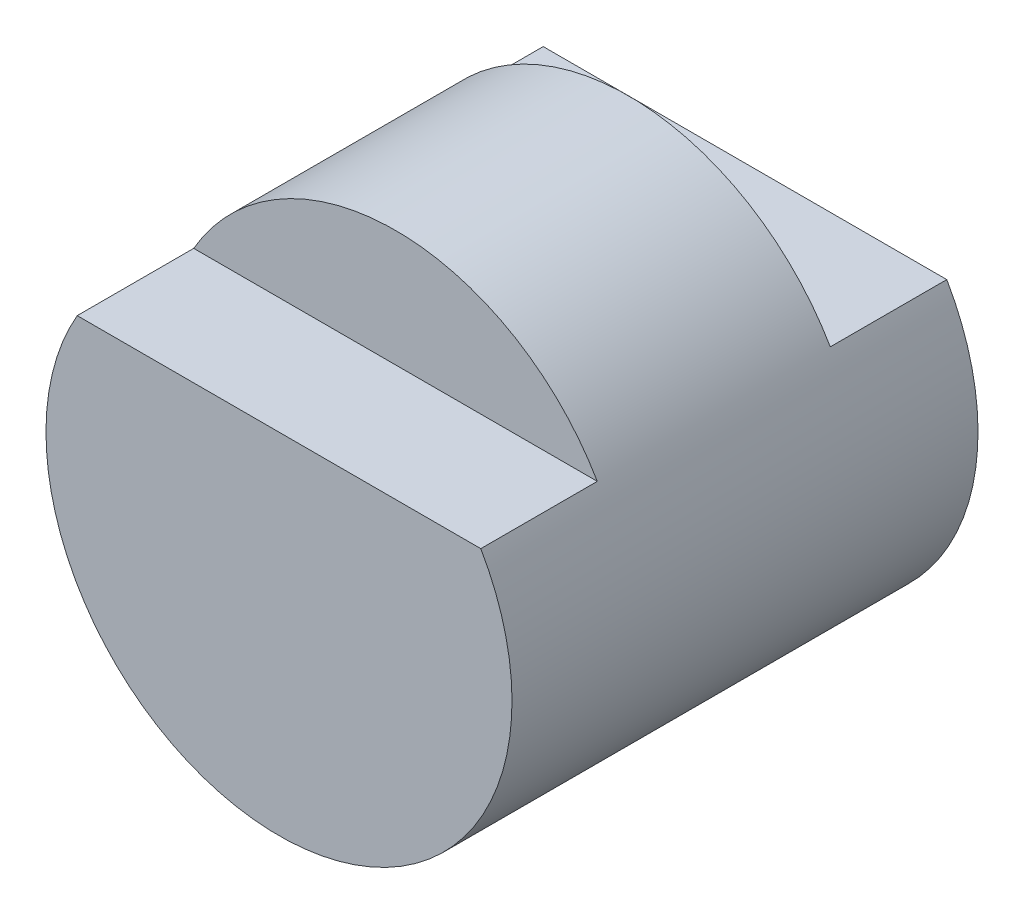
ISO-10303-21;
HEADER;
FILE_DESCRIPTION(('STEP AP214'),'2;1');
FILE_NAME('part.step','',(''),(''),'','','');
FILE_SCHEMA(('AUTOMOTIVE_DESIGN { 1 0 10303 214 1 1 1 1 }'));
ENDSEC;
DATA;
#1=APPLICATION_CONTEXT('core data for automotive mechanical design processes');
#2=APPLICATION_PROTOCOL_DEFINITION('international standard','automotive_design',2000,#1);
#3=PRODUCT_CONTEXT('',#1,'mechanical');
#4=PRODUCT('Part','Part','',(#3));
#5=PRODUCT_RELATED_PRODUCT_CATEGORY('part','',(#4));
#6=PRODUCT_DEFINITION_FORMATION('','',#4);
#7=PRODUCT_DEFINITION_CONTEXT('part definition',#1,'design');
#8=PRODUCT_DEFINITION('design','',#6,#7);
#9=PRODUCT_DEFINITION_SHAPE('','',#8);
#10=(LENGTH_UNIT() NAMED_UNIT(*) SI_UNIT(.MILLI.,.METRE.));
#11=(NAMED_UNIT(*) PLANE_ANGLE_UNIT() SI_UNIT($,.RADIAN.));
#12=(NAMED_UNIT(*) SI_UNIT($,.STERADIAN.) SOLID_ANGLE_UNIT());
#13=UNCERTAINTY_MEASURE_WITH_UNIT(LENGTH_MEASURE(1.E-05),#10,'distance_accuracy_value','');
#14=(GEOMETRIC_REPRESENTATION_CONTEXT(3) GLOBAL_UNCERTAINTY_ASSIGNED_CONTEXT((#13)) GLOBAL_UNIT_ASSIGNED_CONTEXT((#10,
#11,#12)) REPRESENTATION_CONTEXT('',''));
#15=CARTESIAN_POINT('',(0.,0.,0.));
#16=DIRECTION('',(0.,0.,1.));
#17=DIRECTION('',(1.,0.,0.));
#18=AXIS2_PLACEMENT_3D('',#15,#16,#17);
#19=CARTESIAN_POINT('',(0.,0.,4.));
#20=DIRECTION('',(0.,0.,-1.));
#21=DIRECTION('',(-1.,0.,0.));
#22=AXIS2_PLACEMENT_3D('',#19,#20,#21);
#23=CYLINDRICAL_SURFACE('',#22,2.);
#24=CARTESIAN_POINT('',(0.,0.,4.));
#25=DIRECTION('',(0.,0.,1.));
#26=DIRECTION('',(1.,0.,0.));
#27=AXIS2_PLACEMENT_3D('',#24,#25,#26);
#28=CIRCLE('',#27,2.);
#29=CARTESIAN_POINT('',(-1.73205080756888,1.,4.));
#30=VERTEX_POINT('',#29);
#31=CARTESIAN_POINT('',(1.73205080756888,1.,4.));
#32=VERTEX_POINT('',#31);
#33=EDGE_CURVE('E11',#30,#32,#28,.T.);
#34=ORIENTED_EDGE('',*,*,#33,.F.);
#35=DIRECTION('',(0.,0.,1.));
#36=VECTOR('',#35,1.);
#37=CARTESIAN_POINT('',(-1.73205080756888,1.,3.));
#38=LINE('',#37,#36);
#39=CARTESIAN_POINT('',(-1.73205080756888,1.,3.));
#40=VERTEX_POINT('',#39);
#41=EDGE_CURVE('E55',#40,#30,#38,.T.);
#42=ORIENTED_EDGE('',*,*,#41,.F.);
#43=CARTESIAN_POINT('',(0.,0.,3.));
#44=DIRECTION('',(0.,0.,1.));
#45=DIRECTION('',(-1.,0.,0.));
#46=AXIS2_PLACEMENT_3D('',#43,#44,#45);
#47=CIRCLE('',#46,2.);
#48=CARTESIAN_POINT('',(1.73205080756888,1.,3.));
#49=VERTEX_POINT('',#48);
#50=EDGE_CURVE('E92',#49,#40,#47,.T.);
#51=ORIENTED_EDGE('',*,*,#50,.F.);
#52=DIRECTION('',(0.,0.,1.));
#53=VECTOR('',#52,1.);
#54=CARTESIAN_POINT('',(1.73205080756888,1.,3.));
#55=LINE('',#54,#53);
#56=EDGE_CURVE('E98',#49,#32,#55,.T.);
#57=ORIENTED_EDGE('',*,*,#56,.T.);
#58=EDGE_LOOP('',(#34,#42,#51,#57));
#59=FACE_BOUND('',#58,.T.);
#60=CARTESIAN_POINT('',(0.,0.,1.));
#61=DIRECTION('',(0.,0.,-1.));
#62=DIRECTION('',(-1.,0.,0.));
#63=AXIS2_PLACEMENT_3D('',#60,#61,#62);
#64=CIRCLE('',#63,2.);
#65=CARTESIAN_POINT('',(-1.73205080756888,1.,1.));
#66=VERTEX_POINT('',#65);
#67=CARTESIAN_POINT('',(1.73205080756888,1.,1.));
#68=VERTEX_POINT('',#67);
#69=EDGE_CURVE('E75',#66,#68,#64,.T.);
#70=ORIENTED_EDGE('',*,*,#69,.F.);
#71=DIRECTION('',(0.,0.,-1.));
#72=VECTOR('',#71,1.);
#73=CARTESIAN_POINT('',(-1.73205080756888,1.,1.));
#74=LINE('',#73,#72);
#75=CARTESIAN_POINT('',(-1.73205080756888,1.,0.));
#76=VERTEX_POINT('',#75);
#77=EDGE_CURVE('E83',#66,#76,#74,.T.);
#78=ORIENTED_EDGE('',*,*,#77,.T.);
#79=CARTESIAN_POINT('',(0.,0.,0.));
#80=DIRECTION('',(0.,0.,1.));
#81=DIRECTION('',(1.,0.,0.));
#82=AXIS2_PLACEMENT_3D('',#79,#80,#81);
#83=CIRCLE('',#82,2.);
#84=CARTESIAN_POINT('',(1.73205080756888,1.,0.));
#85=VERTEX_POINT('',#84);
#86=EDGE_CURVE('E36',#76,#85,#83,.T.);
#87=ORIENTED_EDGE('',*,*,#86,.T.);
#88=DIRECTION('',(0.,0.,-1.));
#89=VECTOR('',#88,1.);
#90=CARTESIAN_POINT('',(1.73205080756888,1.,1.));
#91=LINE('',#90,#89);
#92=EDGE_CURVE('E47',#68,#85,#91,.T.);
#93=ORIENTED_EDGE('',*,*,#92,.F.);
#94=EDGE_LOOP('',(#70,#78,#87,#93));
#95=FACE_BOUND('',#94,.T.);
#96=ADVANCED_FACE('F33',(#59,#95),#23,.T.);
#97=CARTESIAN_POINT('',(0.,0.,4.));
#98=DIRECTION('',(0.,0.,1.));
#99=DIRECTION('',(1.,0.,0.));
#100=AXIS2_PLACEMENT_3D('',#97,#98,#99);
#101=PLANE('',#100);
#102=DIRECTION('',(1.,0.,0.));
#103=VECTOR('',#102,1.);
#104=CARTESIAN_POINT('',(-1.73205080756888,1.,4.));
#105=LINE('',#104,#103);
#106=EDGE_CURVE('E88',#30,#32,#105,.T.);
#107=ORIENTED_EDGE('',*,*,#106,.F.);
#108=ORIENTED_EDGE('',*,*,#33,.T.);
#109=EDGE_LOOP('',(#107,#108));
#110=FACE_BOUND('',#109,.T.);
#111=ADVANCED_FACE('F105',(#110),#101,.T.);
#112=CARTESIAN_POINT('',(0.,0.,0.));
#113=DIRECTION('',(0.,0.,1.));
#114=DIRECTION('',(1.,0.,0.));
#115=AXIS2_PLACEMENT_3D('',#112,#113,#114);
#116=PLANE('',#115);
#117=ORIENTED_EDGE('',*,*,#86,.F.);
#118=DIRECTION('',(-1.,0.,0.));
#119=VECTOR('',#118,1.);
#120=CARTESIAN_POINT('',(-1.73205080756888,1.,0.));
#121=LINE('',#120,#119);
#122=EDGE_CURVE('E80',#85,#76,#121,.T.);
#123=ORIENTED_EDGE('',*,*,#122,.F.);
#124=EDGE_LOOP('',(#117,#123));
#125=FACE_BOUND('',#124,.T.);
#126=ADVANCED_FACE('F109',(#125),#116,.F.);
#127=CARTESIAN_POINT('',(-1.73205080756888,1.,3.));
#128=DIRECTION('',(0.,-1.,0.));
#129=DIRECTION('',(0.,0.,-1.));
#130=AXIS2_PLACEMENT_3D('',#127,#128,#129);
#131=PLANE('',#130);
#132=ORIENTED_EDGE('',*,*,#106,.T.);
#133=ORIENTED_EDGE('',*,*,#56,.F.);
#134=DIRECTION('',(1.,0.,0.));
#135=VECTOR('',#134,1.);
#136=CARTESIAN_POINT('',(-1.73205080756888,1.,3.));
#137=LINE('',#136,#135);
#138=EDGE_CURVE('E94',#40,#49,#137,.T.);
#139=ORIENTED_EDGE('',*,*,#138,.F.);
#140=ORIENTED_EDGE('',*,*,#41,.T.);
#141=EDGE_LOOP('',(#132,#133,#139,#140));
#142=FACE_BOUND('',#141,.T.);
#143=ADVANCED_FACE('F106',(#142),#131,.F.);
#144=CARTESIAN_POINT('',(0.,0.,3.));
#145=DIRECTION('',(0.,0.,-1.));
#146=DIRECTION('',(-1.,0.,0.));
#147=AXIS2_PLACEMENT_3D('',#144,#145,#146);
#148=PLANE('',#147);
#149=ORIENTED_EDGE('',*,*,#50,.T.);
#150=ORIENTED_EDGE('',*,*,#138,.T.);
#151=EDGE_LOOP('',(#149,#150));
#152=FACE_BOUND('',#151,.T.);
#153=ADVANCED_FACE('F108',(#152),#148,.F.);
#154=CARTESIAN_POINT('',(-1.73205080756888,1.,1.));
#155=DIRECTION('',(0.,-1.,0.));
#156=DIRECTION('',(0.,0.,-1.));
#157=AXIS2_PLACEMENT_3D('',#154,#155,#156);
#158=PLANE('',#157);
#159=ORIENTED_EDGE('',*,*,#122,.T.);
#160=ORIENTED_EDGE('',*,*,#77,.F.);
#161=DIRECTION('',(-1.,0.,0.));
#162=VECTOR('',#161,1.);
#163=CARTESIAN_POINT('',(-1.73205080756888,1.,1.));
#164=LINE('',#163,#162);
#165=EDGE_CURVE('E77',#68,#66,#164,.T.);
#166=ORIENTED_EDGE('',*,*,#165,.F.);
#167=ORIENTED_EDGE('',*,*,#92,.T.);
#168=EDGE_LOOP('',(#159,#160,#166,#167));
#169=FACE_BOUND('',#168,.T.);
#170=ADVANCED_FACE('F82',(#169),#158,.F.);
#171=CARTESIAN_POINT('',(0.,0.,1.));
#172=DIRECTION('',(0.,0.,-1.));
#173=DIRECTION('',(-1.,0.,0.));
#174=AXIS2_PLACEMENT_3D('',#171,#172,#173);
#175=PLANE('',#174);
#176=ORIENTED_EDGE('',*,*,#69,.T.);
#177=ORIENTED_EDGE('',*,*,#165,.T.);
#178=EDGE_LOOP('',(#176,#177));
#179=FACE_BOUND('',#178,.T.);
#180=ADVANCED_FACE('F76',(#179),#175,.T.);
#181=CLOSED_SHELL('',(#96,#111,#126,#143,#153,#170,#180));
#182=MANIFOLD_SOLID_BREP('B2',#181);
#183=ADVANCED_BREP_SHAPE_REPRESENTATION('',(#18,#182),#14);
#184=SHAPE_DEFINITION_REPRESENTATION(#9,#183);
ENDSEC;
END-ISO-10303-21;
